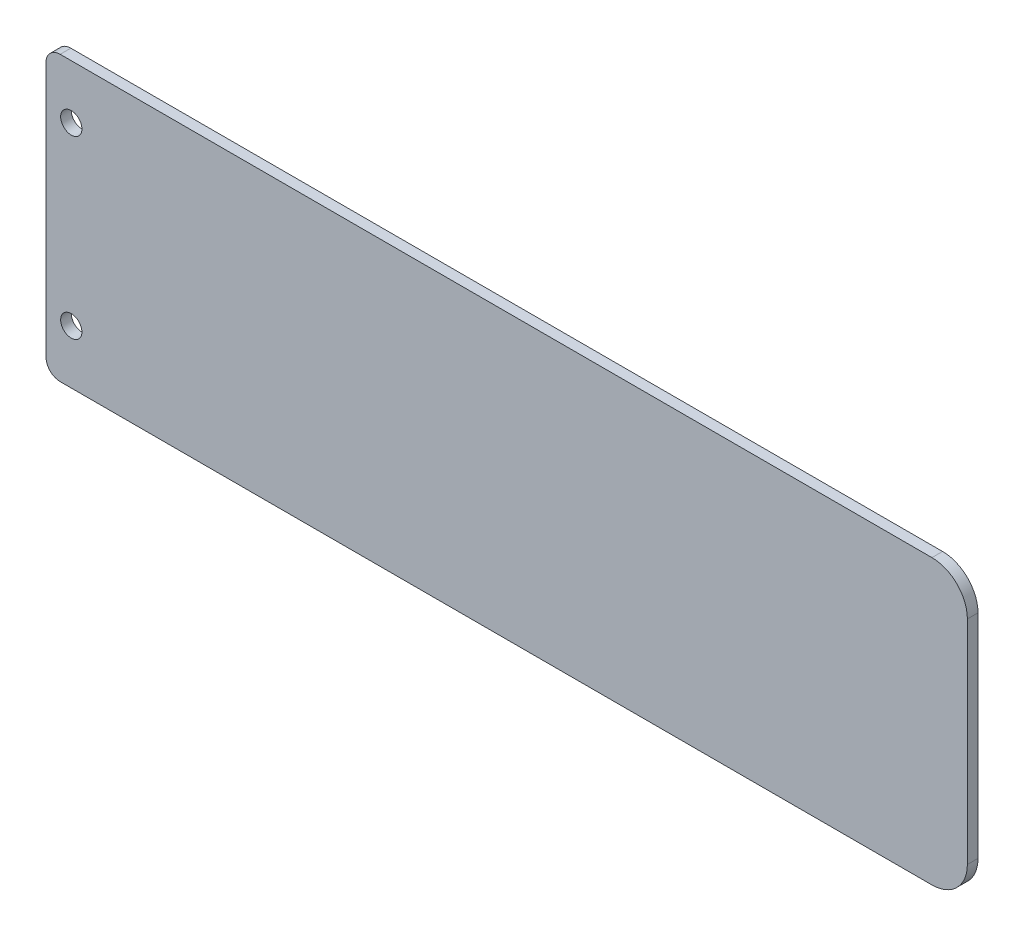
ISO-10303-21;
HEADER;
FILE_DESCRIPTION(('STEP AP214'),'2;1');
FILE_NAME('part.step','',(''),(''),'','','');
FILE_SCHEMA(('AUTOMOTIVE_DESIGN { 1 0 10303 214 1 1 1 1 }'));
ENDSEC;
DATA;
#1=APPLICATION_CONTEXT('core data for automotive mechanical design processes');
#2=APPLICATION_PROTOCOL_DEFINITION('international standard','automotive_design',2000,#1);
#3=PRODUCT_CONTEXT('',#1,'mechanical');
#4=PRODUCT('Part','Part','',(#3));
#5=PRODUCT_RELATED_PRODUCT_CATEGORY('part','',(#4));
#6=PRODUCT_DEFINITION_FORMATION('','',#4);
#7=PRODUCT_DEFINITION_CONTEXT('part definition',#1,'design');
#8=PRODUCT_DEFINITION('design','',#6,#7);
#9=PRODUCT_DEFINITION_SHAPE('','',#8);
#10=(LENGTH_UNIT() NAMED_UNIT(*) SI_UNIT(.MILLI.,.METRE.));
#11=(NAMED_UNIT(*) PLANE_ANGLE_UNIT() SI_UNIT($,.RADIAN.));
#12=(NAMED_UNIT(*) SI_UNIT($,.STERADIAN.) SOLID_ANGLE_UNIT());
#13=UNCERTAINTY_MEASURE_WITH_UNIT(LENGTH_MEASURE(1.E-05),#10,'distance_accuracy_value','');
#14=(GEOMETRIC_REPRESENTATION_CONTEXT(3) GLOBAL_UNCERTAINTY_ASSIGNED_CONTEXT((#13)) GLOBAL_UNIT_ASSIGNED_CONTEXT((#10,
#11,#12)) REPRESENTATION_CONTEXT('',''));
#15=CARTESIAN_POINT('',(0.,0.,0.));
#16=DIRECTION('',(0.,0.,1.));
#17=DIRECTION('',(1.,0.,0.));
#18=AXIS2_PLACEMENT_3D('',#15,#16,#17);
#19=CARTESIAN_POINT('',(0.,0.,3.));
#20=DIRECTION('',(1.,0.,0.));
#21=DIRECTION('',(0.,0.,-1.));
#22=AXIS2_PLACEMENT_3D('',#19,#20,#21);
#23=PLANE('',#22);
#24=DIRECTION('',(0.,-1.,0.));
#25=VECTOR('',#24,1.);
#26=CARTESIAN_POINT('',(0.,0.,0.));
#27=LINE('',#26,#25);
#28=CARTESIAN_POINT('',(0.,76.,0.));
#29=VERTEX_POINT('',#28);
#30=CARTESIAN_POINT('',(0.,4.,0.));
#31=VERTEX_POINT('',#30);
#32=EDGE_CURVE('E142',#29,#31,#27,.T.);
#33=ORIENTED_EDGE('',*,*,#32,.T.);
#34=DIRECTION('',(0.,0.,-1.));
#35=VECTOR('',#34,1.);
#36=CARTESIAN_POINT('',(0.,4.,3.));
#37=LINE('',#36,#35);
#38=CARTESIAN_POINT('',(0.,4.,3.));
#39=VERTEX_POINT('',#38);
#40=EDGE_CURVE('E61',#31,#39,#37,.F.);
#41=ORIENTED_EDGE('',*,*,#40,.T.);
#42=DIRECTION('',(0.,-1.,0.));
#43=VECTOR('',#42,1.);
#44=CARTESIAN_POINT('',(0.,0.,3.));
#45=LINE('',#44,#43);
#46=CARTESIAN_POINT('',(0.,76.,3.));
#47=VERTEX_POINT('',#46);
#48=EDGE_CURVE('E140',#47,#39,#45,.T.);
#49=ORIENTED_EDGE('',*,*,#48,.F.);
#50=DIRECTION('',(0.,0.,-1.));
#51=VECTOR('',#50,1.);
#52=CARTESIAN_POINT('',(0.,76.,3.));
#53=LINE('',#52,#51);
#54=EDGE_CURVE('E182',#47,#29,#53,.T.);
#55=ORIENTED_EDGE('',*,*,#54,.T.);
#56=EDGE_LOOP('',(#33,#41,#49,#55));
#57=FACE_BOUND('',#56,.T.);
#58=ADVANCED_FACE('F39',(#57),#23,.F.);
#59=CARTESIAN_POINT('',(0.,0.,3.));
#60=DIRECTION('',(0.,1.,0.));
#61=DIRECTION('',(0.,0.,1.));
#62=AXIS2_PLACEMENT_3D('',#59,#60,#61);
#63=PLANE('',#62);
#64=DIRECTION('',(1.,0.,0.));
#65=VECTOR('',#64,1.);
#66=CARTESIAN_POINT('',(0.,0.,3.));
#67=LINE('',#66,#65);
#68=CARTESIAN_POINT('',(4.,0.,3.));
#69=VERTEX_POINT('',#68);
#70=CARTESIAN_POINT('',(250.,0.,3.));
#71=VERTEX_POINT('',#70);
#72=EDGE_CURVE('E195',#69,#71,#67,.T.);
#73=ORIENTED_EDGE('',*,*,#72,.F.);
#74=DIRECTION('',(0.,0.,-1.));
#75=VECTOR('',#74,1.);
#76=CARTESIAN_POINT('',(4.,0.,3.));
#77=LINE('',#76,#75);
#78=CARTESIAN_POINT('',(4.,0.,0.));
#79=VERTEX_POINT('',#78);
#80=EDGE_CURVE('E163',#69,#79,#77,.T.);
#81=ORIENTED_EDGE('',*,*,#80,.T.);
#82=DIRECTION('',(1.,0.,0.));
#83=VECTOR('',#82,1.);
#84=CARTESIAN_POINT('',(0.,0.,0.));
#85=LINE('',#84,#83);
#86=CARTESIAN_POINT('',(250.,0.,0.));
#87=VERTEX_POINT('',#86);
#88=EDGE_CURVE('E136',#79,#87,#85,.T.);
#89=ORIENTED_EDGE('',*,*,#88,.T.);
#90=DIRECTION('',(0.,0.,-1.));
#91=VECTOR('',#90,1.);
#92=CARTESIAN_POINT('',(250.,0.,3.));
#93=LINE('',#92,#91);
#94=EDGE_CURVE('E114',#87,#71,#93,.F.);
#95=ORIENTED_EDGE('',*,*,#94,.T.);
#96=EDGE_LOOP('',(#73,#81,#89,#95));
#97=FACE_BOUND('',#96,.T.);
#98=ADVANCED_FACE('F199',(#97),#63,.F.);
#99=CARTESIAN_POINT('',(260.,0.,3.));
#100=DIRECTION('',(-1.,0.,0.));
#101=DIRECTION('',(0.,0.,1.));
#102=AXIS2_PLACEMENT_3D('',#99,#100,#101);
#103=PLANE('',#102);
#104=DIRECTION('',(0.,1.,0.));
#105=VECTOR('',#104,1.);
#106=CARTESIAN_POINT('',(260.,0.,3.));
#107=LINE('',#106,#105);
#108=CARTESIAN_POINT('',(260.,10.,3.));
#109=VERTEX_POINT('',#108);
#110=CARTESIAN_POINT('',(260.,70.,3.));
#111=VERTEX_POINT('',#110);
#112=EDGE_CURVE('E128',#109,#111,#107,.T.);
#113=ORIENTED_EDGE('',*,*,#112,.F.);
#114=DIRECTION('',(0.,0.,-1.));
#115=VECTOR('',#114,1.);
#116=CARTESIAN_POINT('',(260.,10.,3.));
#117=LINE('',#116,#115);
#118=CARTESIAN_POINT('',(260.,10.,0.));
#119=VERTEX_POINT('',#118);
#120=EDGE_CURVE('E112',#109,#119,#117,.T.);
#121=ORIENTED_EDGE('',*,*,#120,.T.);
#122=DIRECTION('',(0.,1.,0.));
#123=VECTOR('',#122,1.);
#124=CARTESIAN_POINT('',(260.,0.,0.));
#125=LINE('',#124,#123);
#126=CARTESIAN_POINT('',(260.,70.,0.));
#127=VERTEX_POINT('',#126);
#128=EDGE_CURVE('E125',#119,#127,#125,.T.);
#129=ORIENTED_EDGE('',*,*,#128,.T.);
#130=DIRECTION('',(0.,0.,-1.));
#131=VECTOR('',#130,1.);
#132=CARTESIAN_POINT('',(260.,70.,3.));
#133=LINE('',#132,#131);
#134=EDGE_CURVE('E130',#127,#111,#133,.F.);
#135=ORIENTED_EDGE('',*,*,#134,.T.);
#136=EDGE_LOOP('',(#113,#121,#129,#135));
#137=FACE_BOUND('',#136,.T.);
#138=ADVANCED_FACE('F124',(#137),#103,.F.);
#139=CARTESIAN_POINT('',(0.,80.,3.));
#140=DIRECTION('',(0.,-1.,0.));
#141=DIRECTION('',(0.,0.,-1.));
#142=AXIS2_PLACEMENT_3D('',#139,#140,#141);
#143=PLANE('',#142);
#144=DIRECTION('',(-1.,0.,0.));
#145=VECTOR('',#144,1.);
#146=CARTESIAN_POINT('',(0.,80.,0.));
#147=LINE('',#146,#145);
#148=CARTESIAN_POINT('',(250.,80.,0.));
#149=VERTEX_POINT('',#148);
#150=CARTESIAN_POINT('',(4.,80.,0.));
#151=VERTEX_POINT('',#150);
#152=EDGE_CURVE('E135',#149,#151,#147,.T.);
#153=ORIENTED_EDGE('',*,*,#152,.T.);
#154=DIRECTION('',(0.,0.,-1.));
#155=VECTOR('',#154,1.);
#156=CARTESIAN_POINT('',(4.,80.,3.));
#157=LINE('',#156,#155);
#158=CARTESIAN_POINT('',(4.,80.,3.));
#159=VERTEX_POINT('',#158);
#160=EDGE_CURVE('E11',#151,#159,#157,.F.);
#161=ORIENTED_EDGE('',*,*,#160,.T.);
#162=DIRECTION('',(-1.,0.,0.));
#163=VECTOR('',#162,1.);
#164=CARTESIAN_POINT('',(0.,80.,3.));
#165=LINE('',#164,#163);
#166=CARTESIAN_POINT('',(250.,80.,3.));
#167=VERTEX_POINT('',#166);
#168=EDGE_CURVE('E147',#167,#159,#165,.T.);
#169=ORIENTED_EDGE('',*,*,#168,.F.);
#170=DIRECTION('',(0.,0.,-1.));
#171=VECTOR('',#170,1.);
#172=CARTESIAN_POINT('',(250.,80.,3.));
#173=LINE('',#172,#171);
#174=EDGE_CURVE('E159',#167,#149,#173,.T.);
#175=ORIENTED_EDGE('',*,*,#174,.T.);
#176=EDGE_LOOP('',(#153,#161,#169,#175));
#177=FACE_BOUND('',#176,.T.);
#178=ADVANCED_FACE('F225',(#177),#143,.F.);
#179=CARTESIAN_POINT('',(0.,0.,3.));
#180=DIRECTION('',(0.,0.,-1.));
#181=DIRECTION('',(-1.,0.,0.));
#182=AXIS2_PLACEMENT_3D('',#179,#180,#181);
#183=PLANE('',#182);
#184=CARTESIAN_POINT('',(7.1337107707589,64.8182892261125,3.));
#185=DIRECTION('',(0.,0.,1.));
#186=DIRECTION('',(1.,0.,0.));
#187=AXIS2_PLACEMENT_3D('',#184,#185,#186);
#188=CIRCLE('',#187,2.99999999999997);
#189=CARTESIAN_POINT('',(10.1337107707589,64.8182892261125,3.));
#190=VERTEX_POINT('',#189);
#191=EDGE_CURVE('E169',#190,#190,#188,.T.);
#192=ORIENTED_EDGE('',*,*,#191,.F.);
#193=EDGE_LOOP('',(#192));
#194=FACE_BOUND('',#193,.T.);
#195=CARTESIAN_POINT('',(7.13371077075888,15.1938611774535,3.));
#196=DIRECTION('',(0.,0.,1.));
#197=DIRECTION('',(1.,0.,0.));
#198=AXIS2_PLACEMENT_3D('',#195,#196,#197);
#199=CIRCLE('',#198,3.);
#200=CARTESIAN_POINT('',(10.1337107707589,15.1938611774535,3.));
#201=VERTEX_POINT('',#200);
#202=EDGE_CURVE('E213',#201,#201,#199,.T.);
#203=ORIENTED_EDGE('',*,*,#202,.F.);
#204=EDGE_LOOP('',(#203));
#205=FACE_BOUND('',#204,.T.);
#206=ORIENTED_EDGE('',*,*,#48,.T.);
#207=CARTESIAN_POINT('',(4.,4.,3.));
#208=DIRECTION('',(0.,0.,-1.));
#209=DIRECTION('',(-1.,0.,0.));
#210=AXIS2_PLACEMENT_3D('',#207,#208,#209);
#211=CIRCLE('',#210,4.);
#212=EDGE_CURVE('E48',#39,#69,#211,.F.);
#213=ORIENTED_EDGE('',*,*,#212,.T.);
#214=ORIENTED_EDGE('',*,*,#72,.T.);
#215=CARTESIAN_POINT('',(250.,10.,3.));
#216=DIRECTION('',(0.,0.,-1.));
#217=DIRECTION('',(-1.,0.,0.));
#218=AXIS2_PLACEMENT_3D('',#215,#216,#217);
#219=CIRCLE('',#218,10.);
#220=EDGE_CURVE('E156',#71,#109,#219,.F.);
#221=ORIENTED_EDGE('',*,*,#220,.T.);
#222=ORIENTED_EDGE('',*,*,#112,.T.);
#223=CARTESIAN_POINT('',(250.,70.,3.));
#224=DIRECTION('',(0.,0.,-1.));
#225=DIRECTION('',(-1.,0.,0.));
#226=AXIS2_PLACEMENT_3D('',#223,#224,#225);
#227=CIRCLE('',#226,10.);
#228=EDGE_CURVE('E153',#111,#167,#227,.F.);
#229=ORIENTED_EDGE('',*,*,#228,.T.);
#230=ORIENTED_EDGE('',*,*,#168,.T.);
#231=CARTESIAN_POINT('',(4.,76.,3.));
#232=DIRECTION('',(0.,0.,-1.));
#233=DIRECTION('',(-1.,0.,0.));
#234=AXIS2_PLACEMENT_3D('',#231,#232,#233);
#235=CIRCLE('',#234,4.);
#236=EDGE_CURVE('E188',#159,#47,#235,.F.);
#237=ORIENTED_EDGE('',*,*,#236,.T.);
#238=EDGE_LOOP('',(#206,#213,#214,#221,#222,#229,#230,#237));
#239=FACE_BOUND('',#238,.T.);
#240=ADVANCED_FACE('F194',(#194,#205,#239),#183,.F.);
#241=CARTESIAN_POINT('',(0.,0.,0.));
#242=DIRECTION('',(0.,0.,-1.));
#243=DIRECTION('',(-1.,0.,0.));
#244=AXIS2_PLACEMENT_3D('',#241,#242,#243);
#245=PLANE('',#244);
#246=CARTESIAN_POINT('',(7.1337107707589,64.8182892261125,0.));
#247=DIRECTION('',(0.,0.,-1.));
#248=DIRECTION('',(-1.,0.,0.));
#249=AXIS2_PLACEMENT_3D('',#246,#247,#248);
#250=CIRCLE('',#249,2.99999999999997);
#251=CARTESIAN_POINT('',(4.13371077075893,64.8182892261125,0.));
#252=VERTEX_POINT('',#251);
#253=EDGE_CURVE('E168',#252,#252,#250,.T.);
#254=ORIENTED_EDGE('',*,*,#253,.F.);
#255=EDGE_LOOP('',(#254));
#256=FACE_BOUND('',#255,.T.);
#257=CARTESIAN_POINT('',(7.13371077075888,15.1938611774535,0.));
#258=DIRECTION('',(0.,0.,-1.));
#259=DIRECTION('',(-1.,0.,0.));
#260=AXIS2_PLACEMENT_3D('',#257,#258,#259);
#261=CIRCLE('',#260,3.);
#262=CARTESIAN_POINT('',(4.13371077075888,15.1938611774535,0.));
#263=VERTEX_POINT('',#262);
#264=EDGE_CURVE('E164',#263,#263,#261,.T.);
#265=ORIENTED_EDGE('',*,*,#264,.F.);
#266=EDGE_LOOP('',(#265));
#267=FACE_BOUND('',#266,.T.);
#268=ORIENTED_EDGE('',*,*,#88,.F.);
#269=CARTESIAN_POINT('',(4.,4.,0.));
#270=DIRECTION('',(0.,0.,-1.));
#271=DIRECTION('',(-1.,0.,0.));
#272=AXIS2_PLACEMENT_3D('',#269,#270,#271);
#273=CIRCLE('',#272,4.);
#274=EDGE_CURVE('E179',#79,#31,#273,.T.);
#275=ORIENTED_EDGE('',*,*,#274,.T.);
#276=ORIENTED_EDGE('',*,*,#32,.F.);
#277=CARTESIAN_POINT('',(4.,76.,0.));
#278=DIRECTION('',(0.,0.,-1.));
#279=DIRECTION('',(-1.,0.,0.));
#280=AXIS2_PLACEMENT_3D('',#277,#278,#279);
#281=CIRCLE('',#280,4.);
#282=EDGE_CURVE('E176',#29,#151,#281,.T.);
#283=ORIENTED_EDGE('',*,*,#282,.T.);
#284=ORIENTED_EDGE('',*,*,#152,.F.);
#285=CARTESIAN_POINT('',(250.,70.,0.));
#286=DIRECTION('',(0.,0.,-1.));
#287=DIRECTION('',(-1.,0.,0.));
#288=AXIS2_PLACEMENT_3D('',#285,#286,#287);
#289=CIRCLE('',#288,10.);
#290=EDGE_CURVE('E119',#149,#127,#289,.T.);
#291=ORIENTED_EDGE('',*,*,#290,.T.);
#292=ORIENTED_EDGE('',*,*,#128,.F.);
#293=CARTESIAN_POINT('',(250.,10.,0.));
#294=DIRECTION('',(0.,0.,-1.));
#295=DIRECTION('',(-1.,0.,0.));
#296=AXIS2_PLACEMENT_3D('',#293,#294,#295);
#297=CIRCLE('',#296,10.);
#298=EDGE_CURVE('E108',#119,#87,#297,.T.);
#299=ORIENTED_EDGE('',*,*,#298,.T.);
#300=EDGE_LOOP('',(#268,#275,#276,#283,#284,#291,#292,#299));
#301=FACE_BOUND('',#300,.T.);
#302=ADVANCED_FACE('F132',(#256,#267,#301),#245,.T.);
#303=CARTESIAN_POINT('',(250.,10.,3.));
#304=DIRECTION('',(0.,0.,-1.));
#305=DIRECTION('',(-1.,0.,0.));
#306=AXIS2_PLACEMENT_3D('',#303,#304,#305);
#307=CYLINDRICAL_SURFACE('',#306,10.);
#308=ORIENTED_EDGE('',*,*,#220,.F.);
#309=ORIENTED_EDGE('',*,*,#94,.F.);
#310=ORIENTED_EDGE('',*,*,#298,.F.);
#311=ORIENTED_EDGE('',*,*,#120,.F.);
#312=EDGE_LOOP('',(#308,#309,#310,#311));
#313=FACE_BOUND('',#312,.T.);
#314=ADVANCED_FACE('F111',(#313),#307,.T.);
#315=CARTESIAN_POINT('',(250.,70.,3.));
#316=DIRECTION('',(0.,0.,-1.));
#317=DIRECTION('',(-1.,0.,0.));
#318=AXIS2_PLACEMENT_3D('',#315,#316,#317);
#319=CYLINDRICAL_SURFACE('',#318,10.);
#320=ORIENTED_EDGE('',*,*,#228,.F.);
#321=ORIENTED_EDGE('',*,*,#134,.F.);
#322=ORIENTED_EDGE('',*,*,#290,.F.);
#323=ORIENTED_EDGE('',*,*,#174,.F.);
#324=EDGE_LOOP('',(#320,#321,#322,#323));
#325=FACE_BOUND('',#324,.T.);
#326=ADVANCED_FACE('F231',(#325),#319,.T.);
#327=CARTESIAN_POINT('',(7.13371077075888,15.1938611774535,-7.));
#328=DIRECTION('',(0.,0.,1.));
#329=DIRECTION('',(1.,0.,0.));
#330=AXIS2_PLACEMENT_3D('',#327,#328,#329);
#331=CYLINDRICAL_SURFACE('',#330,3.);
#332=ORIENTED_EDGE('',*,*,#264,.T.);
#333=EDGE_LOOP('',(#332));
#334=FACE_BOUND('',#333,.T.);
#335=ORIENTED_EDGE('',*,*,#202,.T.);
#336=EDGE_LOOP('',(#335));
#337=FACE_BOUND('',#336,.T.);
#338=ADVANCED_FACE('F229',(#334,#337),#331,.F.);
#339=CARTESIAN_POINT('',(7.1337107707589,64.8182892261125,-7.));
#340=DIRECTION('',(0.,0.,1.));
#341=DIRECTION('',(1.,0.,0.));
#342=AXIS2_PLACEMENT_3D('',#339,#340,#341);
#343=CYLINDRICAL_SURFACE('',#342,2.99999999999997);
#344=ORIENTED_EDGE('',*,*,#253,.T.);
#345=EDGE_LOOP('',(#344));
#346=FACE_BOUND('',#345,.T.);
#347=ORIENTED_EDGE('',*,*,#191,.T.);
#348=EDGE_LOOP('',(#347));
#349=FACE_BOUND('',#348,.T.);
#350=ADVANCED_FACE('F221',(#346,#349),#343,.F.);
#351=CARTESIAN_POINT('',(4.,4.,3.));
#352=DIRECTION('',(0.,0.,-1.));
#353=DIRECTION('',(-1.,0.,0.));
#354=AXIS2_PLACEMENT_3D('',#351,#352,#353);
#355=CYLINDRICAL_SURFACE('',#354,4.);
#356=ORIENTED_EDGE('',*,*,#212,.F.);
#357=ORIENTED_EDGE('',*,*,#40,.F.);
#358=ORIENTED_EDGE('',*,*,#274,.F.);
#359=ORIENTED_EDGE('',*,*,#80,.F.);
#360=EDGE_LOOP('',(#356,#357,#358,#359));
#361=FACE_BOUND('',#360,.T.);
#362=ADVANCED_FACE('F202',(#361),#355,.T.);
#363=CARTESIAN_POINT('',(4.,76.,3.));
#364=DIRECTION('',(0.,0.,-1.));
#365=DIRECTION('',(-1.,0.,0.));
#366=AXIS2_PLACEMENT_3D('',#363,#364,#365);
#367=CYLINDRICAL_SURFACE('',#366,4.);
#368=ORIENTED_EDGE('',*,*,#236,.F.);
#369=ORIENTED_EDGE('',*,*,#160,.F.);
#370=ORIENTED_EDGE('',*,*,#282,.F.);
#371=ORIENTED_EDGE('',*,*,#54,.F.);
#372=EDGE_LOOP('',(#368,#369,#370,#371));
#373=FACE_BOUND('',#372,.T.);
#374=ADVANCED_FACE('F41',(#373),#367,.T.);
#375=CLOSED_SHELL('',(#58,#98,#138,#178,#240,#302,#314,#326,#338,#350,#362,#374));
#376=MANIFOLD_SOLID_BREP('B2',#375);
#377=ADVANCED_BREP_SHAPE_REPRESENTATION('',(#18,#376),#14);
#378=SHAPE_DEFINITION_REPRESENTATION(#9,#377);
ENDSEC;
END-ISO-10303-21;
